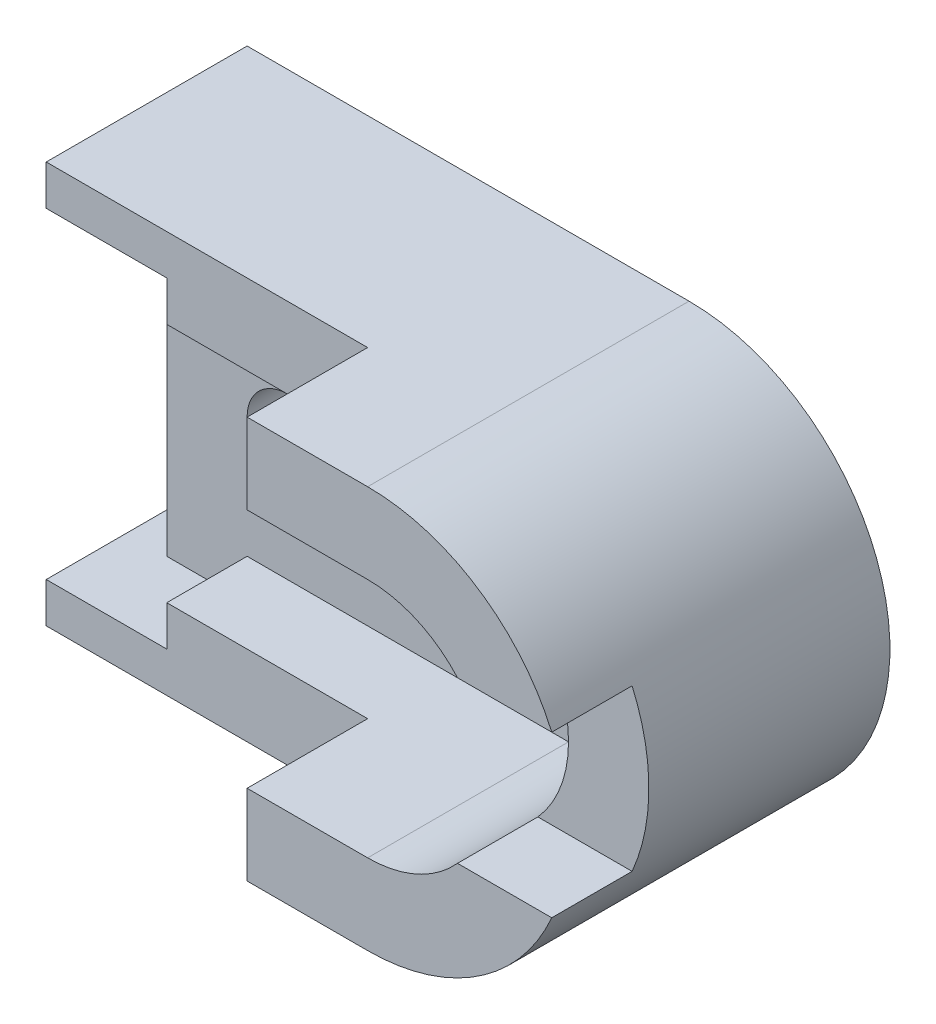
ISO-10303-21;
HEADER;
FILE_DESCRIPTION(('STEP AP214'),'2;1');
FILE_NAME('part.step','',(''),(''),'','','');
FILE_SCHEMA(('AUTOMOTIVE_DESIGN { 1 0 10303 214 1 1 1 1 }'));
ENDSEC;
DATA;
#1=APPLICATION_CONTEXT('core data for automotive mechanical design processes');
#2=APPLICATION_PROTOCOL_DEFINITION('international standard','automotive_design',2000,#1);
#3=PRODUCT_CONTEXT('',#1,'mechanical');
#4=PRODUCT('Part','Part','',(#3));
#5=PRODUCT_RELATED_PRODUCT_CATEGORY('part','',(#4));
#6=PRODUCT_DEFINITION_FORMATION('','',#4);
#7=PRODUCT_DEFINITION_CONTEXT('part definition',#1,'design');
#8=PRODUCT_DEFINITION('design','',#6,#7);
#9=PRODUCT_DEFINITION_SHAPE('','',#8);
#10=(LENGTH_UNIT() NAMED_UNIT(*) SI_UNIT(.MILLI.,.METRE.));
#11=(NAMED_UNIT(*) PLANE_ANGLE_UNIT() SI_UNIT($,.RADIAN.));
#12=(NAMED_UNIT(*) SI_UNIT($,.STERADIAN.) SOLID_ANGLE_UNIT());
#13=UNCERTAINTY_MEASURE_WITH_UNIT(LENGTH_MEASURE(1.E-05),#10,'distance_accuracy_value','');
#14=(GEOMETRIC_REPRESENTATION_CONTEXT(3) GLOBAL_UNCERTAINTY_ASSIGNED_CONTEXT((#13)) GLOBAL_UNIT_ASSIGNED_CONTEXT((#10,
#11,#12)) REPRESENTATION_CONTEXT('',''));
#15=CARTESIAN_POINT('',(0.,0.,0.));
#16=DIRECTION('',(0.,0.,1.));
#17=DIRECTION('',(1.,0.,0.));
#18=AXIS2_PLACEMENT_3D('',#15,#16,#17);
#19=CARTESIAN_POINT('',(80.,-40.,0.));
#20=DIRECTION('',(0.,0.,1.));
#21=DIRECTION('',(1.,0.,0.));
#22=AXIS2_PLACEMENT_3D('',#19,#20,#21);
#23=CYLINDRICAL_SURFACE('',#22,30.);
#24=CARTESIAN_POINT('',(80.,-40.,80.));
#25=DIRECTION('',(0.,0.,-1.));
#26=DIRECTION('',(-1.,0.,0.));
#27=AXIS2_PLACEMENT_3D('',#24,#25,#26);
#28=CIRCLE('',#27,30.);
#29=CARTESIAN_POINT('',(102.360679774998,-60.,80.));
#30=VERTEX_POINT('',#29);
#31=CARTESIAN_POINT('',(80.,-70.,80.));
#32=VERTEX_POINT('',#31);
#33=EDGE_CURVE('E322',#30,#32,#28,.T.);
#34=ORIENTED_EDGE('',*,*,#33,.F.);
#35=DIRECTION('',(0.,0.,1.));
#36=VECTOR('',#35,1.);
#37=CARTESIAN_POINT('',(102.360679774998,-60.,0.));
#38=LINE('',#37,#36);
#39=CARTESIAN_POINT('',(102.360679774998,-60.,60.));
#40=VERTEX_POINT('',#39);
#41=EDGE_CURVE('E316',#30,#40,#38,.F.);
#42=ORIENTED_EDGE('',*,*,#41,.T.);
#43=CARTESIAN_POINT('',(80.,-40.,60.));
#44=DIRECTION('',(0.,0.,1.));
#45=DIRECTION('',(1.,0.,0.));
#46=AXIS2_PLACEMENT_3D('',#43,#44,#45);
#47=CIRCLE('',#46,30.);
#48=CARTESIAN_POINT('',(102.360679774998,-20.,60.));
#49=VERTEX_POINT('',#48);
#50=EDGE_CURVE('E319',#40,#49,#47,.T.);
#51=ORIENTED_EDGE('',*,*,#50,.T.);
#52=DIRECTION('',(0.,0.,1.));
#53=VECTOR('',#52,1.);
#54=CARTESIAN_POINT('',(102.360679774998,-20.,0.));
#55=LINE('',#54,#53);
#56=CARTESIAN_POINT('',(102.360679774998,-20.,80.));
#57=VERTEX_POINT('',#56);
#58=EDGE_CURVE('E310',#49,#57,#55,.T.);
#59=ORIENTED_EDGE('',*,*,#58,.T.);
#60=CARTESIAN_POINT('',(80.,-10.,80.));
#61=VERTEX_POINT('',#60);
#62=EDGE_CURVE('E323',#61,#57,#28,.T.);
#63=ORIENTED_EDGE('',*,*,#62,.F.);
#64=DIRECTION('',(0.,0.,1.));
#65=VECTOR('',#64,1.);
#66=CARTESIAN_POINT('',(80.,-10.,0.));
#67=LINE('',#66,#65);
#68=CARTESIAN_POINT('',(80.,-10.,30.));
#69=VERTEX_POINT('',#68);
#70=EDGE_CURVE('E352',#69,#61,#67,.T.);
#71=ORIENTED_EDGE('',*,*,#70,.F.);
#72=CARTESIAN_POINT('',(80.,-40.,30.));
#73=DIRECTION('',(0.,0.,-1.));
#74=DIRECTION('',(-1.,0.,0.));
#75=AXIS2_PLACEMENT_3D('',#72,#73,#74);
#76=CIRCLE('',#75,30.);
#77=CARTESIAN_POINT('',(80.,-70.,30.));
#78=VERTEX_POINT('',#77);
#79=EDGE_CURVE('E409',#69,#78,#76,.T.);
#80=ORIENTED_EDGE('',*,*,#79,.T.);
#81=DIRECTION('',(0.,0.,1.));
#82=VECTOR('',#81,1.);
#83=CARTESIAN_POINT('',(80.,-70.,0.));
#84=LINE('',#83,#82);
#85=EDGE_CURVE('E351',#78,#32,#84,.T.);
#86=ORIENTED_EDGE('',*,*,#85,.T.);
#87=EDGE_LOOP('',(#34,#42,#51,#59,#63,#71,#80,#86));
#88=FACE_BOUND('',#87,.T.);
#89=ADVANCED_FACE('F35',(#88),#23,.F.);
#90=CARTESIAN_POINT('',(80.,-40.,0.));
#91=DIRECTION('',(0.,0.,1.));
#92=DIRECTION('',(1.,0.,0.));
#93=AXIS2_PLACEMENT_3D('',#90,#91,#92);
#94=CYLINDRICAL_SURFACE('',#93,50.);
#95=CARTESIAN_POINT('',(80.,-40.,60.));
#96=DIRECTION('',(0.,0.,1.));
#97=DIRECTION('',(1.,0.,0.));
#98=AXIS2_PLACEMENT_3D('',#95,#96,#97);
#99=CIRCLE('',#98,50.);
#100=CARTESIAN_POINT('',(125.825756949558,-20.,60.));
#101=VERTEX_POINT('',#100);
#102=CARTESIAN_POINT('',(125.825756949558,-60.,60.));
#103=VERTEX_POINT('',#102);
#104=EDGE_CURVE('E11',#101,#103,#99,.F.);
#105=ORIENTED_EDGE('',*,*,#104,.T.);
#106=DIRECTION('',(0.,0.,1.));
#107=VECTOR('',#106,1.);
#108=CARTESIAN_POINT('',(125.825756949558,-60.,0.));
#109=LINE('',#108,#107);
#110=CARTESIAN_POINT('',(125.825756949558,-60.,80.));
#111=VERTEX_POINT('',#110);
#112=EDGE_CURVE('E313',#103,#111,#109,.T.);
#113=ORIENTED_EDGE('',*,*,#112,.T.);
#114=CARTESIAN_POINT('',(80.,-40.,80.));
#115=DIRECTION('',(0.,0.,1.));
#116=DIRECTION('',(-1.,0.,0.));
#117=AXIS2_PLACEMENT_3D('',#114,#115,#116);
#118=CIRCLE('',#117,50.);
#119=CARTESIAN_POINT('',(80.,-90.,80.));
#120=VERTEX_POINT('',#119);
#121=EDGE_CURVE('E336',#120,#111,#118,.T.);
#122=ORIENTED_EDGE('',*,*,#121,.F.);
#123=DIRECTION('',(0.,0.,1.));
#124=VECTOR('',#123,1.);
#125=CARTESIAN_POINT('',(80.,-90.,0.));
#126=LINE('',#125,#124);
#127=CARTESIAN_POINT('',(80.,-90.,0.));
#128=VERTEX_POINT('',#127);
#129=EDGE_CURVE('E362',#128,#120,#126,.T.);
#130=ORIENTED_EDGE('',*,*,#129,.F.);
#131=CARTESIAN_POINT('',(80.,-40.,0.));
#132=DIRECTION('',(0.,0.,1.));
#133=DIRECTION('',(-1.,0.,0.));
#134=AXIS2_PLACEMENT_3D('',#131,#132,#133);
#135=CIRCLE('',#134,50.);
#136=CARTESIAN_POINT('',(80.,9.99999999999998,0.));
#137=VERTEX_POINT('',#136);
#138=EDGE_CURVE('E348',#128,#137,#135,.T.);
#139=ORIENTED_EDGE('',*,*,#138,.T.);
#140=DIRECTION('',(0.,0.,1.));
#141=VECTOR('',#140,1.);
#142=CARTESIAN_POINT('',(80.,9.99999999999998,0.));
#143=LINE('',#142,#141);
#144=CARTESIAN_POINT('',(80.,9.99999999999998,80.));
#145=VERTEX_POINT('',#144);
#146=EDGE_CURVE('E359',#137,#145,#143,.T.);
#147=ORIENTED_EDGE('',*,*,#146,.T.);
#148=CARTESIAN_POINT('',(125.825756949558,-20.,80.));
#149=VERTEX_POINT('',#148);
#150=EDGE_CURVE('E335',#149,#145,#118,.T.);
#151=ORIENTED_EDGE('',*,*,#150,.F.);
#152=DIRECTION('',(0.,0.,1.));
#153=VECTOR('',#152,1.);
#154=CARTESIAN_POINT('',(125.825756949558,-20.,0.));
#155=LINE('',#154,#153);
#156=EDGE_CURVE('E307',#149,#101,#155,.F.);
#157=ORIENTED_EDGE('',*,*,#156,.T.);
#158=EDGE_LOOP('',(#105,#113,#122,#130,#139,#147,#151,#157));
#159=FACE_BOUND('',#158,.T.);
#160=ADVANCED_FACE('F476',(#159),#94,.T.);
#161=CARTESIAN_POINT('',(80.,-40.,80.));
#162=DIRECTION('',(0.,0.,-1.));
#163=DIRECTION('',(-1.,0.,0.));
#164=AXIS2_PLACEMENT_3D('',#161,#162,#163);
#165=PLANE('',#164);
#166=DIRECTION('',(1.,0.,0.));
#167=VECTOR('',#166,1.);
#168=CARTESIAN_POINT('',(80.,-60.,80.));
#169=LINE('',#168,#167);
#170=EDGE_CURVE('E43',#30,#111,#169,.T.);
#171=ORIENTED_EDGE('',*,*,#170,.F.);
#172=ORIENTED_EDGE('',*,*,#33,.T.);
#173=DIRECTION('',(-1.,0.,0.));
#174=VECTOR('',#173,1.);
#175=CARTESIAN_POINT('',(80.,-70.,80.));
#176=LINE('',#175,#174);
#177=CARTESIAN_POINT('',(50.,-70.,80.));
#178=VERTEX_POINT('',#177);
#179=EDGE_CURVE('E326',#32,#178,#176,.T.);
#180=ORIENTED_EDGE('',*,*,#179,.T.);
#181=DIRECTION('',(0.,-1.,0.));
#182=VECTOR('',#181,1.);
#183=CARTESIAN_POINT('',(50.,-70.,80.));
#184=LINE('',#183,#182);
#185=CARTESIAN_POINT('',(50.,-90.,80.));
#186=VERTEX_POINT('',#185);
#187=EDGE_CURVE('E329',#178,#186,#184,.T.);
#188=ORIENTED_EDGE('',*,*,#187,.T.);
#189=DIRECTION('',(1.,0.,0.));
#190=VECTOR('',#189,1.);
#191=CARTESIAN_POINT('',(80.,-90.,80.));
#192=LINE('',#191,#190);
#193=EDGE_CURVE('E332',#186,#120,#192,.T.);
#194=ORIENTED_EDGE('',*,*,#193,.T.);
#195=ORIENTED_EDGE('',*,*,#121,.T.);
#196=EDGE_LOOP('',(#171,#172,#180,#188,#194,#195));
#197=FACE_BOUND('',#196,.T.);
#198=ADVANCED_FACE('F478',(#197),#165,.F.);
#199=DIRECTION('',(-1.,0.,0.));
#200=VECTOR('',#199,1.);
#201=CARTESIAN_POINT('',(80.,-20.,80.));
#202=LINE('',#201,#200);
#203=EDGE_CURVE('E467',#149,#57,#202,.T.);
#204=ORIENTED_EDGE('',*,*,#203,.F.);
#205=ORIENTED_EDGE('',*,*,#150,.T.);
#206=DIRECTION('',(-1.,0.,0.));
#207=VECTOR('',#206,1.);
#208=CARTESIAN_POINT('',(80.,9.99999999999998,80.));
#209=LINE('',#208,#207);
#210=CARTESIAN_POINT('',(50.,9.99999999999999,80.));
#211=VERTEX_POINT('',#210);
#212=EDGE_CURVE('E339',#145,#211,#209,.T.);
#213=ORIENTED_EDGE('',*,*,#212,.T.);
#214=DIRECTION('',(0.,-1.,0.));
#215=VECTOR('',#214,1.);
#216=CARTESIAN_POINT('',(50.,-10.,80.));
#217=LINE('',#216,#215);
#218=CARTESIAN_POINT('',(50.,-10.,80.));
#219=VERTEX_POINT('',#218);
#220=EDGE_CURVE('E342',#211,#219,#217,.T.);
#221=ORIENTED_EDGE('',*,*,#220,.T.);
#222=DIRECTION('',(1.,0.,0.));
#223=VECTOR('',#222,1.);
#224=CARTESIAN_POINT('',(80.,-10.,80.));
#225=LINE('',#224,#223);
#226=EDGE_CURVE('E345',#219,#61,#225,.T.);
#227=ORIENTED_EDGE('',*,*,#226,.T.);
#228=ORIENTED_EDGE('',*,*,#62,.T.);
#229=EDGE_LOOP('',(#204,#205,#213,#221,#227,#228));
#230=FACE_BOUND('',#229,.T.);
#231=ADVANCED_FACE('F497',(#230),#165,.F.);
#232=CARTESIAN_POINT('',(0.,-10.,50.));
#233=DIRECTION('',(1.,0.,0.));
#234=DIRECTION('',(0.,1.,0.));
#235=AXIS2_PLACEMENT_3D('',#232,#233,#234);
#236=PLANE('',#235);
#237=DIRECTION('',(0.,1.,0.));
#238=VECTOR('',#237,1.);
#239=CARTESIAN_POINT('',(0.,0.,30.));
#240=LINE('',#239,#238);
#241=CARTESIAN_POINT('',(0.,-10.,30.));
#242=VERTEX_POINT('',#241);
#243=CARTESIAN_POINT('',(0.,0.,30.));
#244=VERTEX_POINT('',#243);
#245=EDGE_CURVE('E426',#242,#244,#240,.T.);
#246=ORIENTED_EDGE('',*,*,#245,.F.);
#247=DIRECTION('',(0.,0.,-1.));
#248=VECTOR('',#247,1.);
#249=CARTESIAN_POINT('',(0.,-10.,50.));
#250=LINE('',#249,#248);
#251=CARTESIAN_POINT('',(0.,-10.,50.));
#252=VERTEX_POINT('',#251);
#253=EDGE_CURVE('E464',#252,#242,#250,.T.);
#254=ORIENTED_EDGE('',*,*,#253,.F.);
#255=DIRECTION('',(0.,-1.,0.));
#256=VECTOR('',#255,1.);
#257=CARTESIAN_POINT('',(0.,-10.,50.));
#258=LINE('',#257,#256);
#259=CARTESIAN_POINT('',(0.,0.,50.));
#260=VERTEX_POINT('',#259);
#261=EDGE_CURVE('E437',#260,#252,#258,.T.);
#262=ORIENTED_EDGE('',*,*,#261,.F.);
#263=DIRECTION('',(0.,0.,-1.));
#264=VECTOR('',#263,1.);
#265=CARTESIAN_POINT('',(0.,0.,50.));
#266=LINE('',#265,#264);
#267=EDGE_CURVE('E451',#260,#244,#266,.T.);
#268=ORIENTED_EDGE('',*,*,#267,.T.);
#269=EDGE_LOOP('',(#246,#254,#262,#268));
#270=FACE_BOUND('',#269,.T.);
#271=ADVANCED_FACE('F37',(#270),#236,.F.);
#272=CARTESIAN_POINT('',(50.,-10.,50.));
#273=DIRECTION('',(0.,1.,0.));
#274=DIRECTION('',(-1.,0.,0.));
#275=AXIS2_PLACEMENT_3D('',#272,#273,#274);
#276=PLANE('',#275);
#277=ORIENTED_EDGE('',*,*,#253,.T.);
#278=DIRECTION('',(1.,0.,0.));
#279=VECTOR('',#278,1.);
#280=CARTESIAN_POINT('',(0.,-10.,30.));
#281=LINE('',#280,#279);
#282=EDGE_CURVE('E406',#242,#69,#281,.T.);
#283=ORIENTED_EDGE('',*,*,#282,.T.);
#284=ORIENTED_EDGE('',*,*,#70,.T.);
#285=ORIENTED_EDGE('',*,*,#226,.F.);
#286=DIRECTION('',(0.,0.,1.));
#287=VECTOR('',#286,1.);
#288=CARTESIAN_POINT('',(50.,-10.,0.));
#289=LINE('',#288,#287);
#290=CARTESIAN_POINT('',(50.,-10.,50.));
#291=VERTEX_POINT('',#290);
#292=EDGE_CURVE('E355',#291,#219,#289,.T.);
#293=ORIENTED_EDGE('',*,*,#292,.F.);
#294=DIRECTION('',(1.,0.,0.));
#295=VECTOR('',#294,1.);
#296=CARTESIAN_POINT('',(50.,-10.,50.));
#297=LINE('',#296,#295);
#298=EDGE_CURVE('E440',#252,#291,#297,.T.);
#299=ORIENTED_EDGE('',*,*,#298,.F.);
#300=EDGE_LOOP('',(#277,#283,#284,#285,#293,#299));
#301=FACE_BOUND('',#300,.T.);
#302=ADVANCED_FACE('F565',(#301),#276,.F.);
#303=CARTESIAN_POINT('',(0.,0.,50.));
#304=DIRECTION('',(0.,1.,0.));
#305=DIRECTION('',(0.,0.,1.));
#306=AXIS2_PLACEMENT_3D('',#303,#304,#305);
#307=PLANE('',#306);
#308=DIRECTION('',(0.,0.,-1.));
#309=VECTOR('',#308,1.);
#310=CARTESIAN_POINT('',(-20.,0.,30.));
#311=LINE('',#310,#309);
#312=CARTESIAN_POINT('',(-20.,0.,30.));
#313=VERTEX_POINT('',#312);
#314=CARTESIAN_POINT('',(-20.,0.,0.));
#315=VERTEX_POINT('',#314);
#316=EDGE_CURVE('E432',#313,#315,#311,.T.);
#317=ORIENTED_EDGE('',*,*,#316,.F.);
#318=DIRECTION('',(-1.,0.,0.));
#319=VECTOR('',#318,1.);
#320=CARTESIAN_POINT('',(0.,0.,30.));
#321=LINE('',#320,#319);
#322=EDGE_CURVE('E423',#244,#313,#321,.T.);
#323=ORIENTED_EDGE('',*,*,#322,.F.);
#324=ORIENTED_EDGE('',*,*,#267,.F.);
#325=DIRECTION('',(1.,0.,0.));
#326=VECTOR('',#325,1.);
#327=CARTESIAN_POINT('',(0.,0.,50.));
#328=LINE('',#327,#326);
#329=CARTESIAN_POINT('',(-30.,0.,50.));
#330=VERTEX_POINT('',#329);
#331=EDGE_CURVE('E449',#330,#260,#328,.T.);
#332=ORIENTED_EDGE('',*,*,#331,.F.);
#333=DIRECTION('',(0.,0.,-1.));
#334=VECTOR('',#333,1.);
#335=CARTESIAN_POINT('',(-30.,0.,50.));
#336=LINE('',#335,#334);
#337=CARTESIAN_POINT('',(-30.,0.,0.));
#338=VERTEX_POINT('',#337);
#339=EDGE_CURVE('E458',#330,#338,#336,.T.);
#340=ORIENTED_EDGE('',*,*,#339,.T.);
#341=DIRECTION('',(1.,0.,0.));
#342=VECTOR('',#341,1.);
#343=CARTESIAN_POINT('',(0.,0.,0.));
#344=LINE('',#343,#342);
#345=EDGE_CURVE('E441',#338,#315,#344,.T.);
#346=ORIENTED_EDGE('',*,*,#345,.T.);
#347=EDGE_LOOP('',(#317,#323,#324,#332,#340,#346));
#348=FACE_BOUND('',#347,.T.);
#349=ADVANCED_FACE('F562',(#348),#307,.F.);
#350=CARTESIAN_POINT('',(-30.,9.99999999999999,50.));
#351=DIRECTION('',(0.,-1.,0.));
#352=DIRECTION('',(0.,0.,-1.));
#353=AXIS2_PLACEMENT_3D('',#350,#351,#352);
#354=PLANE('',#353);
#355=DIRECTION('',(-1.,0.,0.));
#356=VECTOR('',#355,1.);
#357=CARTESIAN_POINT('',(-30.,9.99999999999999,0.));
#358=LINE('',#357,#356);
#359=CARTESIAN_POINT('',(-30.,9.99999999999999,0.));
#360=VERTEX_POINT('',#359);
#361=EDGE_CURVE('E435',#137,#360,#358,.T.);
#362=ORIENTED_EDGE('',*,*,#361,.T.);
#363=DIRECTION('',(0.,0.,-1.));
#364=VECTOR('',#363,1.);
#365=CARTESIAN_POINT('',(-30.,9.99999999999999,50.));
#366=LINE('',#365,#364);
#367=CARTESIAN_POINT('',(-30.,9.99999999999999,50.));
#368=VERTEX_POINT('',#367);
#369=EDGE_CURVE('E461',#368,#360,#366,.T.);
#370=ORIENTED_EDGE('',*,*,#369,.F.);
#371=DIRECTION('',(-1.,0.,0.));
#372=VECTOR('',#371,1.);
#373=CARTESIAN_POINT('',(-30.,9.99999999999999,50.));
#374=LINE('',#373,#372);
#375=CARTESIAN_POINT('',(50.,9.99999999999999,50.));
#376=VERTEX_POINT('',#375);
#377=EDGE_CURVE('E445',#376,#368,#374,.T.);
#378=ORIENTED_EDGE('',*,*,#377,.F.);
#379=DIRECTION('',(0.,0.,1.));
#380=VECTOR('',#379,1.);
#381=CARTESIAN_POINT('',(50.,9.99999999999999,0.));
#382=LINE('',#381,#380);
#383=EDGE_CURVE('E357',#376,#211,#382,.T.);
#384=ORIENTED_EDGE('',*,*,#383,.T.);
#385=ORIENTED_EDGE('',*,*,#212,.F.);
#386=ORIENTED_EDGE('',*,*,#146,.F.);
#387=EDGE_LOOP('',(#362,#370,#378,#384,#385,#386));
#388=FACE_BOUND('',#387,.T.);
#389=ADVANCED_FACE('F493',(#388),#354,.F.);
#390=CARTESIAN_POINT('',(-30.,0.,50.));
#391=DIRECTION('',(1.,0.,0.));
#392=DIRECTION('',(0.,0.,-1.));
#393=AXIS2_PLACEMENT_3D('',#390,#391,#392);
#394=PLANE('',#393);
#395=DIRECTION('',(0.,-1.,0.));
#396=VECTOR('',#395,1.);
#397=CARTESIAN_POINT('',(-30.,0.,0.));
#398=LINE('',#397,#396);
#399=EDGE_CURVE('E453',#360,#338,#398,.T.);
#400=ORIENTED_EDGE('',*,*,#399,.T.);
#401=ORIENTED_EDGE('',*,*,#339,.F.);
#402=DIRECTION('',(0.,-1.,0.));
#403=VECTOR('',#402,1.);
#404=CARTESIAN_POINT('',(-30.,0.,50.));
#405=LINE('',#404,#403);
#406=EDGE_CURVE('E447',#368,#330,#405,.T.);
#407=ORIENTED_EDGE('',*,*,#406,.F.);
#408=ORIENTED_EDGE('',*,*,#369,.T.);
#409=EDGE_LOOP('',(#400,#401,#407,#408));
#410=FACE_BOUND('',#409,.T.);
#411=ADVANCED_FACE('F557',(#410),#394,.F.);
#412=CARTESIAN_POINT('',(0.,0.,50.));
#413=DIRECTION('',(0.,0.,1.));
#414=DIRECTION('',(1.,0.,0.));
#415=AXIS2_PLACEMENT_3D('',#412,#413,#414);
#416=PLANE('',#415);
#417=ORIENTED_EDGE('',*,*,#261,.T.);
#418=ORIENTED_EDGE('',*,*,#298,.T.);
#419=DIRECTION('',(0.,1.,0.));
#420=VECTOR('',#419,1.);
#421=CARTESIAN_POINT('',(50.,9.99999999999999,50.));
#422=LINE('',#421,#420);
#423=EDGE_CURVE('E443',#291,#376,#422,.T.);
#424=ORIENTED_EDGE('',*,*,#423,.T.);
#425=ORIENTED_EDGE('',*,*,#377,.T.);
#426=ORIENTED_EDGE('',*,*,#406,.T.);
#427=ORIENTED_EDGE('',*,*,#331,.T.);
#428=EDGE_LOOP('',(#417,#418,#424,#425,#426,#427));
#429=FACE_BOUND('',#428,.T.);
#430=ADVANCED_FACE('F554',(#429),#416,.T.);
#431=CARTESIAN_POINT('',(0.,0.,0.));
#432=DIRECTION('',(0.,0.,1.));
#433=DIRECTION('',(1.,0.,0.));
#434=AXIS2_PLACEMENT_3D('',#431,#432,#433);
#435=PLANE('',#434);
#436=DIRECTION('',(-1.,0.,0.));
#437=VECTOR('',#436,1.);
#438=CARTESIAN_POINT('',(0.,-30.,0.));
#439=LINE('',#438,#437);
#440=CARTESIAN_POINT('',(70.,-30.,0.));
#441=VERTEX_POINT('',#440);
#442=CARTESIAN_POINT('',(60.,-30.,0.));
#443=VERTEX_POINT('',#442);
#444=EDGE_CURVE('E263',#441,#443,#439,.T.);
#445=ORIENTED_EDGE('',*,*,#444,.T.);
#446=CARTESIAN_POINT('',(60.,-40.,0.));
#447=DIRECTION('',(0.,0.,1.));
#448=DIRECTION('',(1.,0.,0.));
#449=AXIS2_PLACEMENT_3D('',#446,#447,#448);
#450=CIRCLE('',#449,10.);
#451=CARTESIAN_POINT('',(60.,-50.,0.));
#452=VERTEX_POINT('',#451);
#453=EDGE_CURVE('E266',#443,#452,#450,.T.);
#454=ORIENTED_EDGE('',*,*,#453,.T.);
#455=DIRECTION('',(1.,0.,0.));
#456=VECTOR('',#455,1.);
#457=CARTESIAN_POINT('',(0.,-50.,0.));
#458=LINE('',#457,#456);
#459=CARTESIAN_POINT('',(70.,-50.,0.));
#460=VERTEX_POINT('',#459);
#461=EDGE_CURVE('E258',#452,#460,#458,.T.);
#462=ORIENTED_EDGE('',*,*,#461,.T.);
#463=CARTESIAN_POINT('',(70.,-40.,0.));
#464=DIRECTION('',(0.,0.,1.));
#465=DIRECTION('',(1.,0.,0.));
#466=AXIS2_PLACEMENT_3D('',#463,#464,#465);
#467=CIRCLE('',#466,10.);
#468=EDGE_CURVE('E238',#460,#441,#467,.T.);
#469=ORIENTED_EDGE('',*,*,#468,.T.);
#470=EDGE_LOOP('',(#445,#454,#462,#469));
#471=FACE_BOUND('',#470,.T.);
#472=DIRECTION('',(-1.,0.,0.));
#473=VECTOR('',#472,1.);
#474=CARTESIAN_POINT('',(0.,-30.,0.));
#475=LINE('',#474,#473);
#476=CARTESIAN_POINT('',(20.,-30.,0.));
#477=VERTEX_POINT('',#476);
#478=CARTESIAN_POINT('',(9.99999999999998,-30.,0.));
#479=VERTEX_POINT('',#478);
#480=EDGE_CURVE('E295',#477,#479,#475,.T.);
#481=ORIENTED_EDGE('',*,*,#480,.T.);
#482=CARTESIAN_POINT('',(9.99999999999998,-40.,0.));
#483=DIRECTION('',(0.,0.,1.));
#484=DIRECTION('',(1.,0.,0.));
#485=AXIS2_PLACEMENT_3D('',#482,#483,#484);
#486=CIRCLE('',#485,10.);
#487=CARTESIAN_POINT('',(9.99999999999998,-50.,0.));
#488=VERTEX_POINT('',#487);
#489=EDGE_CURVE('E298',#479,#488,#486,.T.);
#490=ORIENTED_EDGE('',*,*,#489,.T.);
#491=DIRECTION('',(1.,0.,0.));
#492=VECTOR('',#491,1.);
#493=CARTESIAN_POINT('',(0.,-50.,0.));
#494=LINE('',#493,#492);
#495=CARTESIAN_POINT('',(20.,-50.,0.));
#496=VERTEX_POINT('',#495);
#497=EDGE_CURVE('E283',#488,#496,#494,.T.);
#498=ORIENTED_EDGE('',*,*,#497,.T.);
#499=CARTESIAN_POINT('',(20.,-40.,0.));
#500=DIRECTION('',(0.,0.,1.));
#501=DIRECTION('',(1.,0.,0.));
#502=AXIS2_PLACEMENT_3D('',#499,#500,#501);
#503=CIRCLE('',#502,10.);
#504=EDGE_CURVE('E292',#496,#477,#503,.T.);
#505=ORIENTED_EDGE('',*,*,#504,.T.);
#506=EDGE_LOOP('',(#481,#490,#498,#505));
#507=FACE_BOUND('',#506,.T.);
#508=ORIENTED_EDGE('',*,*,#361,.F.);
#509=ORIENTED_EDGE('',*,*,#138,.F.);
#510=DIRECTION('',(-1.,0.,0.));
#511=VECTOR('',#510,1.);
#512=CARTESIAN_POINT('',(50.,-90.,0.));
#513=LINE('',#512,#511);
#514=CARTESIAN_POINT('',(-30.,-90.,0.));
#515=VERTEX_POINT('',#514);
#516=EDGE_CURVE('E354',#128,#515,#513,.T.);
#517=ORIENTED_EDGE('',*,*,#516,.T.);
#518=DIRECTION('',(0.,1.,0.));
#519=VECTOR('',#518,1.);
#520=CARTESIAN_POINT('',(-30.,-90.,0.));
#521=LINE('',#520,#519);
#522=CARTESIAN_POINT('',(-30.,-80.,0.));
#523=VERTEX_POINT('',#522);
#524=EDGE_CURVE('E392',#515,#523,#521,.T.);
#525=ORIENTED_EDGE('',*,*,#524,.T.);
#526=DIRECTION('',(1.,0.,0.));
#527=VECTOR('',#526,1.);
#528=CARTESIAN_POINT('',(0.,-80.,0.));
#529=LINE('',#528,#527);
#530=CARTESIAN_POINT('',(-20.,-80.,0.));
#531=VERTEX_POINT('',#530);
#532=EDGE_CURVE('E374',#523,#531,#529,.T.);
#533=ORIENTED_EDGE('',*,*,#532,.T.);
#534=DIRECTION('',(0.,-1.,0.));
#535=VECTOR('',#534,1.);
#536=CARTESIAN_POINT('',(-20.,0.,0.));
#537=LINE('',#536,#535);
#538=EDGE_CURVE('E400',#315,#531,#537,.T.);
#539=ORIENTED_EDGE('',*,*,#538,.F.);
#540=ORIENTED_EDGE('',*,*,#345,.F.);
#541=ORIENTED_EDGE('',*,*,#399,.F.);
#542=EDGE_LOOP('',(#508,#509,#517,#525,#533,#539,#540,#541));
#543=FACE_BOUND('',#542,.T.);
#544=ADVANCED_FACE('F486',(#471,#507,#543),#435,.F.);
#545=CARTESIAN_POINT('',(-20.,0.,30.));
#546=DIRECTION('',(1.,0.,0.));
#547=DIRECTION('',(0.,1.,0.));
#548=AXIS2_PLACEMENT_3D('',#545,#546,#547);
#549=PLANE('',#548);
#550=ORIENTED_EDGE('',*,*,#538,.T.);
#551=DIRECTION('',(0.,0.,-1.));
#552=VECTOR('',#551,1.);
#553=CARTESIAN_POINT('',(-20.,-80.,30.));
#554=LINE('',#553,#552);
#555=CARTESIAN_POINT('',(-20.,-80.,30.));
#556=VERTEX_POINT('',#555);
#557=EDGE_CURVE('E429',#556,#531,#554,.T.);
#558=ORIENTED_EDGE('',*,*,#557,.F.);
#559=DIRECTION('',(0.,-1.,0.));
#560=VECTOR('',#559,1.);
#561=CARTESIAN_POINT('',(-20.,0.,30.));
#562=LINE('',#561,#560);
#563=EDGE_CURVE('E420',#313,#556,#562,.T.);
#564=ORIENTED_EDGE('',*,*,#563,.F.);
#565=ORIENTED_EDGE('',*,*,#316,.T.);
#566=EDGE_LOOP('',(#550,#558,#564,#565));
#567=FACE_BOUND('',#566,.T.);
#568=ADVANCED_FACE('F550',(#567),#549,.F.);
#569=CARTESIAN_POINT('',(0.,0.,30.));
#570=DIRECTION('',(0.,0.,-1.));
#571=DIRECTION('',(-1.,0.,0.));
#572=AXIS2_PLACEMENT_3D('',#569,#570,#571);
#573=PLANE('',#572);
#574=DIRECTION('',(1.,0.,0.));
#575=VECTOR('',#574,1.);
#576=CARTESIAN_POINT('',(60.,-50.,30.));
#577=LINE('',#576,#575);
#578=CARTESIAN_POINT('',(60.,-50.,30.));
#579=VERTEX_POINT('',#578);
#580=CARTESIAN_POINT('',(70.,-50.,30.));
#581=VERTEX_POINT('',#580);
#582=EDGE_CURVE('E244',#579,#581,#577,.T.);
#583=ORIENTED_EDGE('',*,*,#582,.F.);
#584=CARTESIAN_POINT('',(60.,-40.,30.));
#585=DIRECTION('',(0.,0.,1.));
#586=DIRECTION('',(1.,0.,0.));
#587=AXIS2_PLACEMENT_3D('',#584,#585,#586);
#588=CIRCLE('',#587,10.);
#589=CARTESIAN_POINT('',(60.,-30.,30.));
#590=VERTEX_POINT('',#589);
#591=EDGE_CURVE('E58',#590,#579,#588,.T.);
#592=ORIENTED_EDGE('',*,*,#591,.F.);
#593=DIRECTION('',(-1.,0.,0.));
#594=VECTOR('',#593,1.);
#595=CARTESIAN_POINT('',(70.,-30.,30.));
#596=LINE('',#595,#594);
#597=CARTESIAN_POINT('',(70.,-30.,30.));
#598=VERTEX_POINT('',#597);
#599=EDGE_CURVE('E251',#598,#590,#596,.T.);
#600=ORIENTED_EDGE('',*,*,#599,.F.);
#601=CARTESIAN_POINT('',(70.,-40.,30.));
#602=DIRECTION('',(0.,0.,1.));
#603=DIRECTION('',(-1.,0.,0.));
#604=AXIS2_PLACEMENT_3D('',#601,#602,#603);
#605=CIRCLE('',#604,10.);
#606=EDGE_CURVE('E235',#581,#598,#605,.T.);
#607=ORIENTED_EDGE('',*,*,#606,.F.);
#608=EDGE_LOOP('',(#583,#592,#600,#607));
#609=FACE_BOUND('',#608,.T.);
#610=DIRECTION('',(1.,0.,0.));
#611=VECTOR('',#610,1.);
#612=CARTESIAN_POINT('',(9.99999999999998,-50.,30.));
#613=LINE('',#612,#611);
#614=CARTESIAN_POINT('',(9.99999999999998,-50.,30.));
#615=VERTEX_POINT('',#614);
#616=CARTESIAN_POINT('',(20.,-50.,30.));
#617=VERTEX_POINT('',#616);
#618=EDGE_CURVE('E271',#615,#617,#613,.T.);
#619=ORIENTED_EDGE('',*,*,#618,.F.);
#620=CARTESIAN_POINT('',(9.99999999999998,-40.,30.));
#621=DIRECTION('',(0.,0.,1.));
#622=DIRECTION('',(1.,0.,0.));
#623=AXIS2_PLACEMENT_3D('',#620,#621,#622);
#624=CIRCLE('',#623,10.);
#625=CARTESIAN_POINT('',(9.99999999999998,-30.,30.));
#626=VERTEX_POINT('',#625);
#627=EDGE_CURVE('E269',#626,#615,#624,.T.);
#628=ORIENTED_EDGE('',*,*,#627,.F.);
#629=DIRECTION('',(-1.,0.,0.));
#630=VECTOR('',#629,1.);
#631=CARTESIAN_POINT('',(9.99999999999998,-30.,30.));
#632=LINE('',#631,#630);
#633=CARTESIAN_POINT('',(20.,-30.,30.));
#634=VERTEX_POINT('',#633);
#635=EDGE_CURVE('E277',#634,#626,#632,.T.);
#636=ORIENTED_EDGE('',*,*,#635,.F.);
#637=CARTESIAN_POINT('',(20.,-40.,30.));
#638=DIRECTION('',(0.,0.,1.));
#639=DIRECTION('',(-1.,0.,0.));
#640=AXIS2_PLACEMENT_3D('',#637,#638,#639);
#641=CIRCLE('',#640,10.);
#642=EDGE_CURVE('E274',#617,#634,#641,.T.);
#643=ORIENTED_EDGE('',*,*,#642,.F.);
#644=EDGE_LOOP('',(#619,#628,#636,#643));
#645=FACE_BOUND('',#644,.T.);
#646=ORIENTED_EDGE('',*,*,#282,.F.);
#647=ORIENTED_EDGE('',*,*,#245,.T.);
#648=ORIENTED_EDGE('',*,*,#322,.T.);
#649=ORIENTED_EDGE('',*,*,#563,.T.);
#650=DIRECTION('',(1.,0.,0.));
#651=VECTOR('',#650,1.);
#652=CARTESIAN_POINT('',(0.,-80.,30.));
#653=LINE('',#652,#651);
#654=CARTESIAN_POINT('',(0.,-80.,30.));
#655=VERTEX_POINT('',#654);
#656=EDGE_CURVE('E417',#556,#655,#653,.T.);
#657=ORIENTED_EDGE('',*,*,#656,.T.);
#658=DIRECTION('',(0.,1.,0.));
#659=VECTOR('',#658,1.);
#660=CARTESIAN_POINT('',(0.,0.,30.));
#661=LINE('',#660,#659);
#662=CARTESIAN_POINT('',(0.,-70.,30.));
#663=VERTEX_POINT('',#662);
#664=EDGE_CURVE('E414',#655,#663,#661,.T.);
#665=ORIENTED_EDGE('',*,*,#664,.T.);
#666=DIRECTION('',(1.,0.,0.));
#667=VECTOR('',#666,1.);
#668=CARTESIAN_POINT('',(0.,-70.,30.));
#669=LINE('',#668,#667);
#670=EDGE_CURVE('E412',#663,#78,#669,.T.);
#671=ORIENTED_EDGE('',*,*,#670,.T.);
#672=ORIENTED_EDGE('',*,*,#79,.F.);
#673=EDGE_LOOP('',(#646,#647,#648,#649,#657,#665,#671,#672));
#674=FACE_BOUND('',#673,.T.);
#675=ADVANCED_FACE('F248',(#609,#645,#674),#573,.F.);
#676=CARTESIAN_POINT('',(0.,-70.,50.));
#677=DIRECTION('',(0.,1.,0.));
#678=DIRECTION('',(0.,0.,1.));
#679=AXIS2_PLACEMENT_3D('',#676,#677,#678);
#680=PLANE('',#679);
#681=ORIENTED_EDGE('',*,*,#670,.F.);
#682=DIRECTION('',(0.,0.,-1.));
#683=VECTOR('',#682,1.);
#684=CARTESIAN_POINT('',(0.,-70.,50.));
#685=LINE('',#684,#683);
#686=CARTESIAN_POINT('',(0.,-70.,50.));
#687=VERTEX_POINT('',#686);
#688=EDGE_CURVE('E397',#687,#663,#685,.T.);
#689=ORIENTED_EDGE('',*,*,#688,.F.);
#690=DIRECTION('',(1.,0.,0.));
#691=VECTOR('',#690,1.);
#692=CARTESIAN_POINT('',(0.,-70.,50.));
#693=LINE('',#692,#691);
#694=CARTESIAN_POINT('',(50.,-70.,50.));
#695=VERTEX_POINT('',#694);
#696=EDGE_CURVE('E370',#687,#695,#693,.T.);
#697=ORIENTED_EDGE('',*,*,#696,.T.);
#698=DIRECTION('',(0.,0.,1.));
#699=VECTOR('',#698,1.);
#700=CARTESIAN_POINT('',(50.,-70.,0.));
#701=LINE('',#700,#699);
#702=EDGE_CURVE('E366',#695,#178,#701,.T.);
#703=ORIENTED_EDGE('',*,*,#702,.T.);
#704=ORIENTED_EDGE('',*,*,#179,.F.);
#705=ORIENTED_EDGE('',*,*,#85,.F.);
#706=EDGE_LOOP('',(#681,#689,#697,#703,#704,#705));
#707=FACE_BOUND('',#706,.T.);
#708=ADVANCED_FACE('F534',(#707),#680,.T.);
#709=CARTESIAN_POINT('',(0.,-70.,50.));
#710=DIRECTION('',(-1.,0.,0.));
#711=DIRECTION('',(0.,0.,1.));
#712=AXIS2_PLACEMENT_3D('',#709,#710,#711);
#713=PLANE('',#712);
#714=ORIENTED_EDGE('',*,*,#664,.F.);
#715=DIRECTION('',(0.,0.,-1.));
#716=VECTOR('',#715,1.);
#717=CARTESIAN_POINT('',(0.,-80.,50.));
#718=LINE('',#717,#716);
#719=CARTESIAN_POINT('',(0.,-80.,50.));
#720=VERTEX_POINT('',#719);
#721=EDGE_CURVE('E401',#720,#655,#718,.T.);
#722=ORIENTED_EDGE('',*,*,#721,.F.);
#723=DIRECTION('',(0.,1.,0.));
#724=VECTOR('',#723,1.);
#725=CARTESIAN_POINT('',(0.,-70.,50.));
#726=LINE('',#725,#724);
#727=EDGE_CURVE('E386',#720,#687,#726,.T.);
#728=ORIENTED_EDGE('',*,*,#727,.T.);
#729=ORIENTED_EDGE('',*,*,#688,.T.);
#730=EDGE_LOOP('',(#714,#722,#728,#729));
#731=FACE_BOUND('',#730,.T.);
#732=ADVANCED_FACE('F530',(#731),#713,.T.);
#733=CARTESIAN_POINT('',(0.,-80.,50.));
#734=DIRECTION('',(0.,1.,0.));
#735=DIRECTION('',(0.,0.,1.));
#736=AXIS2_PLACEMENT_3D('',#733,#734,#735);
#737=PLANE('',#736);
#738=ORIENTED_EDGE('',*,*,#557,.T.);
#739=ORIENTED_EDGE('',*,*,#532,.F.);
#740=DIRECTION('',(0.,0.,-1.));
#741=VECTOR('',#740,1.);
#742=CARTESIAN_POINT('',(-30.,-80.,50.));
#743=LINE('',#742,#741);
#744=CARTESIAN_POINT('',(-30.,-80.,50.));
#745=VERTEX_POINT('',#744);
#746=EDGE_CURVE('E403',#745,#523,#743,.T.);
#747=ORIENTED_EDGE('',*,*,#746,.F.);
#748=DIRECTION('',(1.,0.,0.));
#749=VECTOR('',#748,1.);
#750=CARTESIAN_POINT('',(0.,-80.,50.));
#751=LINE('',#750,#749);
#752=EDGE_CURVE('E383',#745,#720,#751,.T.);
#753=ORIENTED_EDGE('',*,*,#752,.T.);
#754=ORIENTED_EDGE('',*,*,#721,.T.);
#755=ORIENTED_EDGE('',*,*,#656,.F.);
#756=EDGE_LOOP('',(#738,#739,#747,#753,#754,#755));
#757=FACE_BOUND('',#756,.T.);
#758=ADVANCED_FACE('F533',(#757),#737,.T.);
#759=CARTESIAN_POINT('',(-30.,-90.,50.));
#760=DIRECTION('',(-1.,0.,0.));
#761=DIRECTION('',(0.,-1.,0.));
#762=AXIS2_PLACEMENT_3D('',#759,#760,#761);
#763=PLANE('',#762);
#764=ORIENTED_EDGE('',*,*,#524,.F.);
#765=DIRECTION('',(0.,0.,-1.));
#766=VECTOR('',#765,1.);
#767=CARTESIAN_POINT('',(-30.,-90.,50.));
#768=LINE('',#767,#766);
#769=CARTESIAN_POINT('',(-30.,-90.,50.));
#770=VERTEX_POINT('',#769);
#771=EDGE_CURVE('E389',#770,#515,#768,.T.);
#772=ORIENTED_EDGE('',*,*,#771,.F.);
#773=DIRECTION('',(0.,1.,0.));
#774=VECTOR('',#773,1.);
#775=CARTESIAN_POINT('',(-30.,-90.,50.));
#776=LINE('',#775,#774);
#777=EDGE_CURVE('E380',#770,#745,#776,.T.);
#778=ORIENTED_EDGE('',*,*,#777,.T.);
#779=ORIENTED_EDGE('',*,*,#746,.T.);
#780=EDGE_LOOP('',(#764,#772,#778,#779));
#781=FACE_BOUND('',#780,.T.);
#782=ADVANCED_FACE('F538',(#781),#763,.T.);
#783=CARTESIAN_POINT('',(50.,-90.,50.));
#784=DIRECTION('',(0.,-1.,0.));
#785=DIRECTION('',(0.,0.,-1.));
#786=AXIS2_PLACEMENT_3D('',#783,#784,#785);
#787=PLANE('',#786);
#788=ORIENTED_EDGE('',*,*,#516,.F.);
#789=ORIENTED_EDGE('',*,*,#129,.T.);
#790=ORIENTED_EDGE('',*,*,#193,.F.);
#791=DIRECTION('',(0.,0.,1.));
#792=VECTOR('',#791,1.);
#793=CARTESIAN_POINT('',(50.,-90.,0.));
#794=LINE('',#793,#792);
#795=CARTESIAN_POINT('',(50.,-90.,50.));
#796=VERTEX_POINT('',#795);
#797=EDGE_CURVE('E364',#796,#186,#794,.T.);
#798=ORIENTED_EDGE('',*,*,#797,.F.);
#799=DIRECTION('',(-1.,0.,0.));
#800=VECTOR('',#799,1.);
#801=CARTESIAN_POINT('',(50.,-90.,50.));
#802=LINE('',#801,#800);
#803=EDGE_CURVE('E377',#796,#770,#802,.T.);
#804=ORIENTED_EDGE('',*,*,#803,.T.);
#805=ORIENTED_EDGE('',*,*,#771,.T.);
#806=EDGE_LOOP('',(#788,#789,#790,#798,#804,#805));
#807=FACE_BOUND('',#806,.T.);
#808=ADVANCED_FACE('F483',(#807),#787,.T.);
#809=CARTESIAN_POINT('',(0.,0.,50.));
#810=DIRECTION('',(0.,0.,-1.));
#811=DIRECTION('',(-1.,0.,0.));
#812=AXIS2_PLACEMENT_3D('',#809,#810,#811);
#813=PLANE('',#812);
#814=ORIENTED_EDGE('',*,*,#696,.F.);
#815=ORIENTED_EDGE('',*,*,#727,.F.);
#816=ORIENTED_EDGE('',*,*,#752,.F.);
#817=ORIENTED_EDGE('',*,*,#777,.F.);
#818=ORIENTED_EDGE('',*,*,#803,.F.);
#819=DIRECTION('',(0.,-1.,0.));
#820=VECTOR('',#819,1.);
#821=CARTESIAN_POINT('',(50.,-70.,50.));
#822=LINE('',#821,#820);
#823=EDGE_CURVE('E373',#695,#796,#822,.T.);
#824=ORIENTED_EDGE('',*,*,#823,.F.);
#825=EDGE_LOOP('',(#814,#815,#816,#817,#818,#824));
#826=FACE_BOUND('',#825,.T.);
#827=ADVANCED_FACE('F526',(#826),#813,.F.);
#828=CARTESIAN_POINT('',(50.,-70.,0.));
#829=DIRECTION('',(-1.,0.,0.));
#830=DIRECTION('',(0.,0.,1.));
#831=AXIS2_PLACEMENT_3D('',#828,#829,#830);
#832=PLANE('',#831);
#833=ORIENTED_EDGE('',*,*,#823,.T.);
#834=ORIENTED_EDGE('',*,*,#797,.T.);
#835=ORIENTED_EDGE('',*,*,#187,.F.);
#836=ORIENTED_EDGE('',*,*,#702,.F.);
#837=EDGE_LOOP('',(#833,#834,#835,#836));
#838=FACE_BOUND('',#837,.T.);
#839=ADVANCED_FACE('F525',(#838),#832,.T.);
#840=CARTESIAN_POINT('',(50.,-10.,0.));
#841=DIRECTION('',(-1.,0.,0.));
#842=DIRECTION('',(0.,-1.,0.));
#843=AXIS2_PLACEMENT_3D('',#840,#841,#842);
#844=PLANE('',#843);
#845=ORIENTED_EDGE('',*,*,#383,.F.);
#846=ORIENTED_EDGE('',*,*,#423,.F.);
#847=ORIENTED_EDGE('',*,*,#292,.T.);
#848=ORIENTED_EDGE('',*,*,#220,.F.);
#849=EDGE_LOOP('',(#845,#846,#847,#848));
#850=FACE_BOUND('',#849,.T.);
#851=ADVANCED_FACE('F515',(#850),#844,.T.);
#852=CARTESIAN_POINT('',(211.,-60.,80.));
#853=DIRECTION('',(0.,1.,0.));
#854=DIRECTION('',(0.,0.,1.));
#855=AXIS2_PLACEMENT_3D('',#852,#853,#854);
#856=PLANE('',#855);
#857=ORIENTED_EDGE('',*,*,#170,.T.);
#858=ORIENTED_EDGE('',*,*,#112,.F.);
#859=DIRECTION('',(-1.,0.,0.));
#860=VECTOR('',#859,1.);
#861=CARTESIAN_POINT('',(211.,-60.,60.));
#862=LINE('',#861,#860);
#863=EDGE_CURVE('E304',#103,#40,#862,.T.);
#864=ORIENTED_EDGE('',*,*,#863,.T.);
#865=ORIENTED_EDGE('',*,*,#41,.F.);
#866=EDGE_LOOP('',(#857,#858,#864,#865));
#867=FACE_BOUND('',#866,.T.);
#868=ADVANCED_FACE('F470',(#867),#856,.T.);
#869=CARTESIAN_POINT('',(211.,-20.,60.));
#870=DIRECTION('',(0.,0.,1.));
#871=DIRECTION('',(1.,0.,0.));
#872=AXIS2_PLACEMENT_3D('',#869,#870,#871);
#873=PLANE('',#872);
#874=ORIENTED_EDGE('',*,*,#863,.F.);
#875=ORIENTED_EDGE('',*,*,#104,.F.);
#876=DIRECTION('',(-1.,0.,0.));
#877=VECTOR('',#876,1.);
#878=CARTESIAN_POINT('',(211.,-20.,60.));
#879=LINE('',#878,#877);
#880=EDGE_CURVE('E301',#101,#49,#879,.T.);
#881=ORIENTED_EDGE('',*,*,#880,.T.);
#882=ORIENTED_EDGE('',*,*,#50,.F.);
#883=EDGE_LOOP('',(#874,#875,#881,#882));
#884=FACE_BOUND('',#883,.T.);
#885=ADVANCED_FACE('F506',(#884),#873,.T.);
#886=CARTESIAN_POINT('',(211.,-20.,80.));
#887=DIRECTION('',(0.,-1.,0.));
#888=DIRECTION('',(0.,0.,-1.));
#889=AXIS2_PLACEMENT_3D('',#886,#887,#888);
#890=PLANE('',#889);
#891=ORIENTED_EDGE('',*,*,#880,.F.);
#892=ORIENTED_EDGE('',*,*,#156,.F.);
#893=ORIENTED_EDGE('',*,*,#203,.T.);
#894=ORIENTED_EDGE('',*,*,#58,.F.);
#895=EDGE_LOOP('',(#891,#892,#893,#894));
#896=FACE_BOUND('',#895,.T.);
#897=ADVANCED_FACE('F502',(#896),#890,.T.);
#898=CARTESIAN_POINT('',(9.99999999999998,-40.,-181.));
#899=DIRECTION('',(0.,0.,1.));
#900=DIRECTION('',(1.,0.,0.));
#901=AXIS2_PLACEMENT_3D('',#898,#899,#900);
#902=CYLINDRICAL_SURFACE('',#901,10.);
#903=DIRECTION('',(0.,0.,1.));
#904=VECTOR('',#903,1.);
#905=CARTESIAN_POINT('',(9.99999999999998,-30.,-181.));
#906=LINE('',#905,#904);
#907=EDGE_CURVE('E281',#479,#626,#906,.T.);
#908=ORIENTED_EDGE('',*,*,#907,.T.);
#909=ORIENTED_EDGE('',*,*,#627,.T.);
#910=DIRECTION('',(0.,0.,1.));
#911=VECTOR('',#910,1.);
#912=CARTESIAN_POINT('',(9.99999999999998,-50.,-181.));
#913=LINE('',#912,#911);
#914=EDGE_CURVE('E280',#488,#615,#913,.T.);
#915=ORIENTED_EDGE('',*,*,#914,.F.);
#916=ORIENTED_EDGE('',*,*,#489,.F.);
#917=EDGE_LOOP('',(#908,#909,#915,#916));
#918=FACE_BOUND('',#917,.T.);
#919=ADVANCED_FACE('F513',(#918),#902,.F.);
#920=CARTESIAN_POINT('',(9.99999999999998,-30.,-181.));
#921=DIRECTION('',(0.,1.,0.));
#922=DIRECTION('',(0.,0.,1.));
#923=AXIS2_PLACEMENT_3D('',#920,#921,#922);
#924=PLANE('',#923);
#925=DIRECTION('',(0.,0.,1.));
#926=VECTOR('',#925,1.);
#927=CARTESIAN_POINT('',(20.,-30.,-181.));
#928=LINE('',#927,#926);
#929=EDGE_CURVE('E284',#477,#634,#928,.T.);
#930=ORIENTED_EDGE('',*,*,#929,.T.);
#931=ORIENTED_EDGE('',*,*,#635,.T.);
#932=ORIENTED_EDGE('',*,*,#907,.F.);
#933=ORIENTED_EDGE('',*,*,#480,.F.);
#934=EDGE_LOOP('',(#930,#931,#932,#933));
#935=FACE_BOUND('',#934,.T.);
#936=ADVANCED_FACE('F746',(#935),#924,.F.);
#937=CARTESIAN_POINT('',(20.,-40.,-181.));
#938=DIRECTION('',(0.,0.,1.));
#939=DIRECTION('',(1.,0.,0.));
#940=AXIS2_PLACEMENT_3D('',#937,#938,#939);
#941=CYLINDRICAL_SURFACE('',#940,10.);
#942=DIRECTION('',(0.,0.,1.));
#943=VECTOR('',#942,1.);
#944=CARTESIAN_POINT('',(20.,-50.,-181.));
#945=LINE('',#944,#943);
#946=EDGE_CURVE('E286',#496,#617,#945,.T.);
#947=ORIENTED_EDGE('',*,*,#946,.T.);
#948=ORIENTED_EDGE('',*,*,#642,.T.);
#949=ORIENTED_EDGE('',*,*,#929,.F.);
#950=ORIENTED_EDGE('',*,*,#504,.F.);
#951=EDGE_LOOP('',(#947,#948,#949,#950));
#952=FACE_BOUND('',#951,.T.);
#953=ADVANCED_FACE('F755',(#952),#941,.F.);
#954=CARTESIAN_POINT('',(9.99999999999998,-50.,-181.));
#955=DIRECTION('',(0.,-1.,0.));
#956=DIRECTION('',(0.,0.,-1.));
#957=AXIS2_PLACEMENT_3D('',#954,#955,#956);
#958=PLANE('',#957);
#959=ORIENTED_EDGE('',*,*,#914,.T.);
#960=ORIENTED_EDGE('',*,*,#618,.T.);
#961=ORIENTED_EDGE('',*,*,#946,.F.);
#962=ORIENTED_EDGE('',*,*,#497,.F.);
#963=EDGE_LOOP('',(#959,#960,#961,#962));
#964=FACE_BOUND('',#963,.T.);
#965=ADVANCED_FACE('F764',(#964),#958,.F.);
#966=CARTESIAN_POINT('',(60.,-40.,-181.));
#967=DIRECTION('',(0.,0.,1.));
#968=DIRECTION('',(1.,0.,0.));
#969=AXIS2_PLACEMENT_3D('',#966,#967,#968);
#970=CYLINDRICAL_SURFACE('',#969,10.);
#971=DIRECTION('',(0.,0.,1.));
#972=VECTOR('',#971,1.);
#973=CARTESIAN_POINT('',(60.,-30.,-181.));
#974=LINE('',#973,#972);
#975=EDGE_CURVE('E256',#443,#590,#974,.T.);
#976=ORIENTED_EDGE('',*,*,#975,.T.);
#977=ORIENTED_EDGE('',*,*,#591,.T.);
#978=DIRECTION('',(0.,0.,1.));
#979=VECTOR('',#978,1.);
#980=CARTESIAN_POINT('',(60.,-50.,-181.));
#981=LINE('',#980,#979);
#982=EDGE_CURVE('E241',#452,#579,#981,.T.);
#983=ORIENTED_EDGE('',*,*,#982,.F.);
#984=ORIENTED_EDGE('',*,*,#453,.F.);
#985=EDGE_LOOP('',(#976,#977,#983,#984));
#986=FACE_BOUND('',#985,.T.);
#987=ADVANCED_FACE('F773',(#986),#970,.F.);
#988=CARTESIAN_POINT('',(70.,-30.,-181.));
#989=DIRECTION('',(0.,1.,0.));
#990=DIRECTION('',(0.,0.,1.));
#991=AXIS2_PLACEMENT_3D('',#988,#989,#990);
#992=PLANE('',#991);
#993=DIRECTION('',(0.,0.,1.));
#994=VECTOR('',#993,1.);
#995=CARTESIAN_POINT('',(70.,-30.,-181.));
#996=LINE('',#995,#994);
#997=EDGE_CURVE('E240',#441,#598,#996,.T.);
#998=ORIENTED_EDGE('',*,*,#997,.T.);
#999=ORIENTED_EDGE('',*,*,#599,.T.);
#1000=ORIENTED_EDGE('',*,*,#975,.F.);
#1001=ORIENTED_EDGE('',*,*,#444,.F.);
#1002=EDGE_LOOP('',(#998,#999,#1000,#1001));
#1003=FACE_BOUND('',#1002,.T.);
#1004=ADVANCED_FACE('F783',(#1003),#992,.F.);
#1005=CARTESIAN_POINT('',(70.,-40.,-181.));
#1006=DIRECTION('',(0.,0.,1.));
#1007=DIRECTION('',(1.,0.,0.));
#1008=AXIS2_PLACEMENT_3D('',#1005,#1006,#1007);
#1009=CYLINDRICAL_SURFACE('',#1008,10.);
#1010=DIRECTION('',(0.,0.,1.));
#1011=VECTOR('',#1010,1.);
#1012=CARTESIAN_POINT('',(70.,-50.,-181.));
#1013=LINE('',#1012,#1011);
#1014=EDGE_CURVE('E50',#460,#581,#1013,.T.);
#1015=ORIENTED_EDGE('',*,*,#1014,.T.);
#1016=ORIENTED_EDGE('',*,*,#606,.T.);
#1017=ORIENTED_EDGE('',*,*,#997,.F.);
#1018=ORIENTED_EDGE('',*,*,#468,.F.);
#1019=EDGE_LOOP('',(#1015,#1016,#1017,#1018));
#1020=FACE_BOUND('',#1019,.T.);
#1021=ADVANCED_FACE('F232',(#1020),#1009,.F.);
#1022=CARTESIAN_POINT('',(60.,-50.,-181.));
#1023=DIRECTION('',(0.,-1.,0.));
#1024=DIRECTION('',(0.,0.,-1.));
#1025=AXIS2_PLACEMENT_3D('',#1022,#1023,#1024);
#1026=PLANE('',#1025);
#1027=ORIENTED_EDGE('',*,*,#982,.T.);
#1028=ORIENTED_EDGE('',*,*,#582,.T.);
#1029=ORIENTED_EDGE('',*,*,#1014,.F.);
#1030=ORIENTED_EDGE('',*,*,#461,.F.);
#1031=EDGE_LOOP('',(#1027,#1028,#1029,#1030));
#1032=FACE_BOUND('',#1031,.T.);
#1033=ADVANCED_FACE('F245',(#1032),#1026,.F.);
#1034=CLOSED_SHELL('',(#89,#160,#198,#231,#271,#302,#349,#389,#411,#430,#544,#568,#675,#708,
#732,#758,#782,#808,#827,#839,#851,#868,#885,#897,#919,#936,#953,#965,#987,#1004,#1021,#1033));
#1035=MANIFOLD_SOLID_BREP('B2',#1034);
#1036=ADVANCED_BREP_SHAPE_REPRESENTATION('',(#18,#1035),#14);
#1037=SHAPE_DEFINITION_REPRESENTATION(#9,#1036);
ENDSEC;
END-ISO-10303-21;
